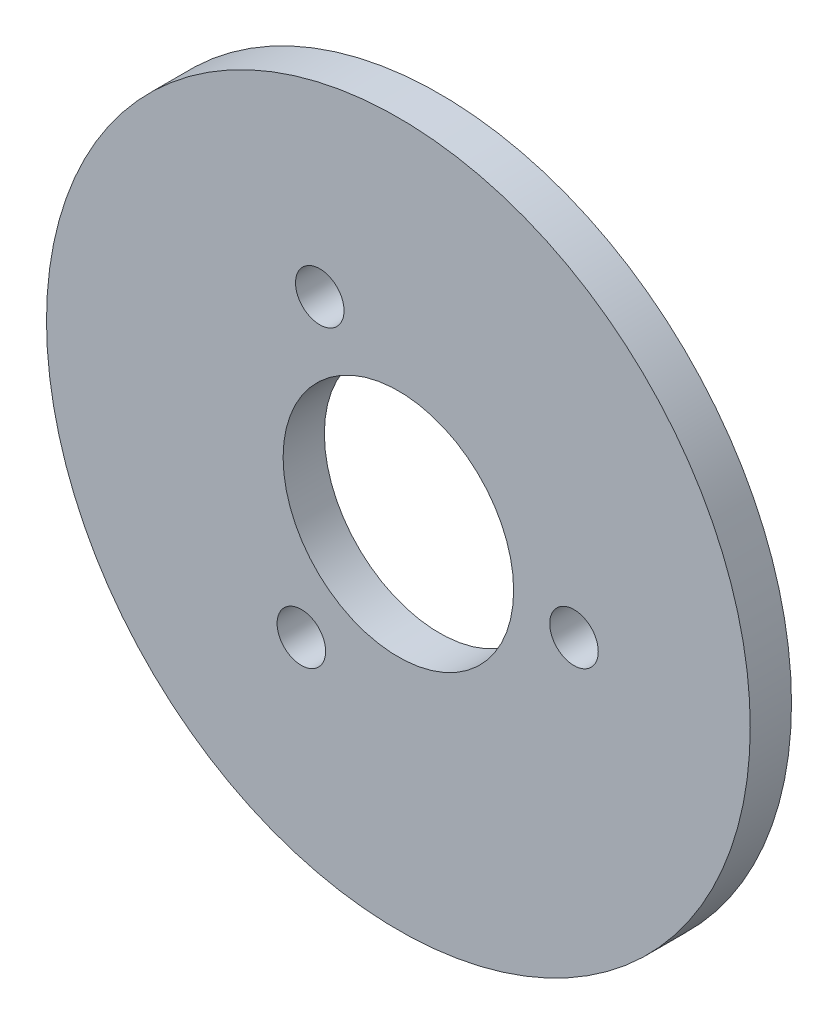
ISO-10303-21;
HEADER;
FILE_DESCRIPTION(('STEP AP214'),'2;1');
FILE_NAME('part.step','',(''),(''),'','','');
FILE_SCHEMA(('AUTOMOTIVE_DESIGN { 1 0 10303 214 1 1 1 1 }'));
ENDSEC;
DATA;
#1=APPLICATION_CONTEXT('core data for automotive mechanical design processes');
#2=APPLICATION_PROTOCOL_DEFINITION('international standard','automotive_design',2000,#1);
#3=PRODUCT_CONTEXT('',#1,'mechanical');
#4=PRODUCT('Part','Part','',(#3));
#5=PRODUCT_RELATED_PRODUCT_CATEGORY('part','',(#4));
#6=PRODUCT_DEFINITION_FORMATION('','',#4);
#7=PRODUCT_DEFINITION_CONTEXT('part definition',#1,'design');
#8=PRODUCT_DEFINITION('design','',#6,#7);
#9=PRODUCT_DEFINITION_SHAPE('','',#8);
#10=(LENGTH_UNIT() NAMED_UNIT(*) SI_UNIT(.MILLI.,.METRE.));
#11=(NAMED_UNIT(*) PLANE_ANGLE_UNIT() SI_UNIT($,.RADIAN.));
#12=(NAMED_UNIT(*) SI_UNIT($,.STERADIAN.) SOLID_ANGLE_UNIT());
#13=UNCERTAINTY_MEASURE_WITH_UNIT(LENGTH_MEASURE(1.E-05),#10,'distance_accuracy_value','');
#14=(GEOMETRIC_REPRESENTATION_CONTEXT(3) GLOBAL_UNCERTAINTY_ASSIGNED_CONTEXT((#13)) GLOBAL_UNIT_ASSIGNED_CONTEXT((#10,
#11,#12)) REPRESENTATION_CONTEXT('',''));
#15=CARTESIAN_POINT('',(0.,0.,0.));
#16=DIRECTION('',(0.,0.,1.));
#17=DIRECTION('',(1.,0.,0.));
#18=AXIS2_PLACEMENT_3D('',#15,#16,#17);
#19=CARTESIAN_POINT('',(0.,0.,3.4));
#20=DIRECTION('',(0.,0.,1.));
#21=DIRECTION('',(1.,0.,0.));
#22=AXIS2_PLACEMENT_3D('',#19,#20,#21);
#23=PLANE('',#22);
#24=CARTESIAN_POINT('',(14.4735207895494,-0.875897228273961,3.4));
#25=DIRECTION('',(0.,0.,1.));
#26=DIRECTION('',(1.,0.,0.));
#27=AXIS2_PLACEMENT_3D('',#24,#25,#26);
#28=CIRCLE('',#27,2.00000000000107);
#29=CARTESIAN_POINT('',(16.4735207895504,-0.875897228273961,3.4));
#30=VERTEX_POINT('',#29);
#31=EDGE_CURVE('E64',#30,#30,#28,.T.);
#32=ORIENTED_EDGE('',*,*,#31,.F.);
#33=EDGE_LOOP('',(#32));
#34=FACE_BOUND('',#33,.T.);
#35=CARTESIAN_POINT('',(0.,0.,3.4));
#36=DIRECTION('',(0.,0.,1.));
#37=DIRECTION('',(1.,0.,0.));
#38=AXIS2_PLACEMENT_3D('',#35,#36,#37);
#39=CIRCLE('',#38,9.5);
#40=CARTESIAN_POINT('',(9.5,0.,3.4));
#41=VERTEX_POINT('',#40);
#42=EDGE_CURVE('E50',#41,#41,#39,.T.);
#43=ORIENTED_EDGE('',*,*,#42,.F.);
#44=EDGE_LOOP('',(#43));
#45=FACE_BOUND('',#44,.T.);
#46=CARTESIAN_POINT('',(0.,0.,3.4));
#47=DIRECTION('',(0.,0.,1.));
#48=DIRECTION('',(1.,0.,0.));
#49=AXIS2_PLACEMENT_3D('',#46,#47,#48);
#50=CIRCLE('',#49,29.);
#51=CARTESIAN_POINT('',(29.,0.,3.4));
#52=VERTEX_POINT('',#51);
#53=EDGE_CURVE('E10',#52,#52,#50,.T.);
#54=ORIENTED_EDGE('',*,*,#53,.T.);
#55=EDGE_LOOP('',(#54));
#56=FACE_BOUND('',#55,.T.);
#57=CARTESIAN_POINT('',(-6.47821114398399,12.9723853000889,3.4));
#58=DIRECTION('',(0.,0.,1.));
#59=DIRECTION('',(1.,0.,0.));
#60=AXIS2_PLACEMENT_3D('',#57,#58,#59);
#61=CIRCLE('',#60,2.);
#62=CARTESIAN_POINT('',(-4.47821114398399,12.9723853000889,3.4));
#63=VERTEX_POINT('',#62);
#64=EDGE_CURVE('E56',#63,#63,#61,.T.);
#65=ORIENTED_EDGE('',*,*,#64,.F.);
#66=EDGE_LOOP('',(#65));
#67=FACE_BOUND('',#66,.T.);
#68=CARTESIAN_POINT('',(-7.99530964556372,-12.0964880718141,3.4));
#69=DIRECTION('',(0.,0.,1.));
#70=DIRECTION('',(1.,0.,0.));
#71=AXIS2_PLACEMENT_3D('',#68,#69,#70);
#72=CIRCLE('',#71,2.00000000000096);
#73=CARTESIAN_POINT('',(-5.99530964556276,-12.0964880718141,3.4));
#74=VERTEX_POINT('',#73);
#75=EDGE_CURVE('E72',#74,#74,#72,.T.);
#76=ORIENTED_EDGE('',*,*,#75,.F.);
#77=EDGE_LOOP('',(#76));
#78=FACE_BOUND('',#77,.T.);
#79=ADVANCED_FACE('F37',(#34,#45,#56,#67,#78),#23,.T.);
#80=CARTESIAN_POINT('',(0.,0.,0.));
#81=DIRECTION('',(0.,0.,1.));
#82=DIRECTION('',(1.,0.,0.));
#83=AXIS2_PLACEMENT_3D('',#80,#81,#82);
#84=PLANE('',#83);
#85=CARTESIAN_POINT('',(0.,0.,0.));
#86=DIRECTION('',(0.,0.,1.));
#87=DIRECTION('',(1.,0.,0.));
#88=AXIS2_PLACEMENT_3D('',#85,#86,#87);
#89=CIRCLE('',#88,29.);
#90=CARTESIAN_POINT('',(29.,0.,0.));
#91=VERTEX_POINT('',#90);
#92=EDGE_CURVE('E41',#91,#91,#89,.T.);
#93=ORIENTED_EDGE('',*,*,#92,.F.);
#94=EDGE_LOOP('',(#93));
#95=FACE_BOUND('',#94,.T.);
#96=CARTESIAN_POINT('',(0.,0.,0.));
#97=DIRECTION('',(0.,0.,1.));
#98=DIRECTION('',(1.,0.,0.));
#99=AXIS2_PLACEMENT_3D('',#96,#97,#98);
#100=CIRCLE('',#99,9.5);
#101=CARTESIAN_POINT('',(9.5,0.,0.));
#102=VERTEX_POINT('',#101);
#103=EDGE_CURVE('E52',#102,#102,#100,.T.);
#104=ORIENTED_EDGE('',*,*,#103,.T.);
#105=EDGE_LOOP('',(#104));
#106=FACE_BOUND('',#105,.T.);
#107=CARTESIAN_POINT('',(-6.47821114398399,12.9723853000889,0.));
#108=DIRECTION('',(0.,0.,1.));
#109=DIRECTION('',(1.,0.,0.));
#110=AXIS2_PLACEMENT_3D('',#107,#108,#109);
#111=CIRCLE('',#110,2.);
#112=CARTESIAN_POINT('',(-4.47821114398399,12.9723853000889,0.));
#113=VERTEX_POINT('',#112);
#114=EDGE_CURVE('E60',#113,#113,#111,.T.);
#115=ORIENTED_EDGE('',*,*,#114,.T.);
#116=EDGE_LOOP('',(#115));
#117=FACE_BOUND('',#116,.T.);
#118=CARTESIAN_POINT('',(14.4735207895494,-0.875897228273961,0.));
#119=DIRECTION('',(0.,0.,1.));
#120=DIRECTION('',(1.,0.,0.));
#121=AXIS2_PLACEMENT_3D('',#118,#119,#120);
#122=CIRCLE('',#121,2.00000000000107);
#123=CARTESIAN_POINT('',(16.4735207895504,-0.875897228273961,0.));
#124=VERTEX_POINT('',#123);
#125=EDGE_CURVE('E68',#124,#124,#122,.T.);
#126=ORIENTED_EDGE('',*,*,#125,.T.);
#127=EDGE_LOOP('',(#126));
#128=FACE_BOUND('',#127,.T.);
#129=CARTESIAN_POINT('',(-7.99530964556372,-12.0964880718141,0.));
#130=DIRECTION('',(0.,0.,1.));
#131=DIRECTION('',(1.,0.,0.));
#132=AXIS2_PLACEMENT_3D('',#129,#130,#131);
#133=CIRCLE('',#132,2.00000000000096);
#134=CARTESIAN_POINT('',(-5.99530964556276,-12.0964880718141,0.));
#135=VERTEX_POINT('',#134);
#136=EDGE_CURVE('E76',#135,#135,#133,.T.);
#137=ORIENTED_EDGE('',*,*,#136,.T.);
#138=EDGE_LOOP('',(#137));
#139=FACE_BOUND('',#138,.T.);
#140=ADVANCED_FACE('F88',(#95,#106,#117,#128,#139),#84,.F.);
#141=CARTESIAN_POINT('',(0.,0.,3.4));
#142=DIRECTION('',(0.,0.,-1.));
#143=DIRECTION('',(-1.,0.,0.));
#144=AXIS2_PLACEMENT_3D('',#141,#142,#143);
#145=CYLINDRICAL_SURFACE('',#144,29.);
#146=ORIENTED_EDGE('',*,*,#53,.F.);
#147=EDGE_LOOP('',(#146));
#148=FACE_BOUND('',#147,.T.);
#149=ORIENTED_EDGE('',*,*,#92,.T.);
#150=EDGE_LOOP('',(#149));
#151=FACE_BOUND('',#150,.T.);
#152=ADVANCED_FACE('F39',(#148,#151),#145,.T.);
#153=CARTESIAN_POINT('',(0.,0.,3.4));
#154=DIRECTION('',(0.,0.,-1.));
#155=DIRECTION('',(-1.,0.,0.));
#156=AXIS2_PLACEMENT_3D('',#153,#154,#155);
#157=CYLINDRICAL_SURFACE('',#156,9.5);
#158=ORIENTED_EDGE('',*,*,#42,.T.);
#159=EDGE_LOOP('',(#158));
#160=FACE_BOUND('',#159,.T.);
#161=ORIENTED_EDGE('',*,*,#103,.F.);
#162=EDGE_LOOP('',(#161));
#163=FACE_BOUND('',#162,.T.);
#164=ADVANCED_FACE('F98',(#160,#163),#157,.F.);
#165=CARTESIAN_POINT('',(-6.47821114398399,12.9723853000889,3.4));
#166=DIRECTION('',(0.,0.,-1.));
#167=DIRECTION('',(-1.,0.,0.));
#168=AXIS2_PLACEMENT_3D('',#165,#166,#167);
#169=CYLINDRICAL_SURFACE('',#168,2.);
#170=ORIENTED_EDGE('',*,*,#64,.T.);
#171=EDGE_LOOP('',(#170));
#172=FACE_BOUND('',#171,.T.);
#173=ORIENTED_EDGE('',*,*,#114,.F.);
#174=EDGE_LOOP('',(#173));
#175=FACE_BOUND('',#174,.T.);
#176=ADVANCED_FACE('F101',(#172,#175),#169,.F.);
#177=CARTESIAN_POINT('',(14.4735207895494,-0.875897228273961,3.4));
#178=DIRECTION('',(0.,0.,-1.));
#179=DIRECTION('',(-1.,0.,0.));
#180=AXIS2_PLACEMENT_3D('',#177,#178,#179);
#181=CYLINDRICAL_SURFACE('',#180,2.00000000000107);
#182=ORIENTED_EDGE('',*,*,#31,.T.);
#183=EDGE_LOOP('',(#182));
#184=FACE_BOUND('',#183,.T.);
#185=ORIENTED_EDGE('',*,*,#125,.F.);
#186=EDGE_LOOP('',(#185));
#187=FACE_BOUND('',#186,.T.);
#188=ADVANCED_FACE('F105',(#184,#187),#181,.F.);
#189=CARTESIAN_POINT('',(-7.99530964556372,-12.0964880718141,3.4));
#190=DIRECTION('',(0.,0.,-1.));
#191=DIRECTION('',(-1.,0.,0.));
#192=AXIS2_PLACEMENT_3D('',#189,#190,#191);
#193=CYLINDRICAL_SURFACE('',#192,2.00000000000096);
#194=ORIENTED_EDGE('',*,*,#75,.T.);
#195=EDGE_LOOP('',(#194));
#196=FACE_BOUND('',#195,.T.);
#197=ORIENTED_EDGE('',*,*,#136,.F.);
#198=EDGE_LOOP('',(#197));
#199=FACE_BOUND('',#198,.T.);
#200=ADVANCED_FACE('F84',(#196,#199),#193,.F.);
#201=CLOSED_SHELL('',(#79,#140,#152,#164,#176,#188,#200));
#202=MANIFOLD_SOLID_BREP('B2',#201);
#203=ADVANCED_BREP_SHAPE_REPRESENTATION('',(#18,#202),#14);
#204=SHAPE_DEFINITION_REPRESENTATION(#9,#203);
ENDSEC;
END-ISO-10303-21;
